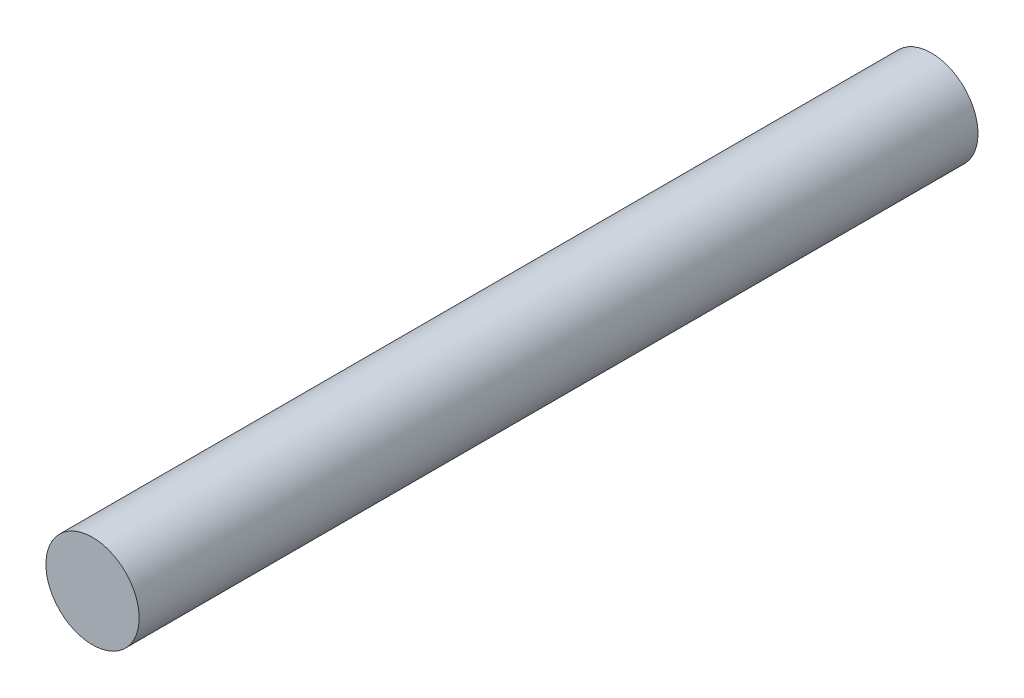
ISO-10303-21;
HEADER;
FILE_DESCRIPTION(('STEP AP214'),'2;1');
FILE_NAME('part.step','',(''),(''),'','','');
FILE_SCHEMA(('AUTOMOTIVE_DESIGN { 1 0 10303 214 1 1 1 1 }'));
ENDSEC;
DATA;
#1=APPLICATION_CONTEXT('core data for automotive mechanical design processes');
#2=APPLICATION_PROTOCOL_DEFINITION('international standard','automotive_design',2000,#1);
#3=PRODUCT_CONTEXT('',#1,'mechanical');
#4=PRODUCT('Part','Part','',(#3));
#5=PRODUCT_RELATED_PRODUCT_CATEGORY('part','',(#4));
#6=PRODUCT_DEFINITION_FORMATION('','',#4);
#7=PRODUCT_DEFINITION_CONTEXT('part definition',#1,'design');
#8=PRODUCT_DEFINITION('design','',#6,#7);
#9=PRODUCT_DEFINITION_SHAPE('','',#8);
#10=(LENGTH_UNIT() NAMED_UNIT(*) SI_UNIT(.MILLI.,.METRE.));
#11=(NAMED_UNIT(*) PLANE_ANGLE_UNIT() SI_UNIT($,.RADIAN.));
#12=(NAMED_UNIT(*) SI_UNIT($,.STERADIAN.) SOLID_ANGLE_UNIT());
#13=UNCERTAINTY_MEASURE_WITH_UNIT(LENGTH_MEASURE(1.E-05),#10,'distance_accuracy_value','');
#14=(GEOMETRIC_REPRESENTATION_CONTEXT(3) GLOBAL_UNCERTAINTY_ASSIGNED_CONTEXT((#13)) GLOBAL_UNIT_ASSIGNED_CONTEXT((#10,
#11,#12)) REPRESENTATION_CONTEXT('',''));
#15=CARTESIAN_POINT('',(0.,0.,0.));
#16=DIRECTION('',(0.,0.,1.));
#17=DIRECTION('',(1.,0.,0.));
#18=AXIS2_PLACEMENT_3D('',#15,#16,#17);
#19=CARTESIAN_POINT('',(-5.824,-4.501,-9.1));
#20=DIRECTION('',(0.,0.,-1.));
#21=DIRECTION('',(-1.,0.,0.));
#22=AXIS2_PLACEMENT_3D('',#19,#20,#21);
#23=PLANE('',#22);
#24=CARTESIAN_POINT('',(-6.125,-4.2,-9.1));
#25=DIRECTION('',(0.,0.,1.));
#26=DIRECTION('',(1.,0.,0.));
#27=AXIS2_PLACEMENT_3D('',#24,#25,#26);
#28=CIRCLE('',#27,0.300000000000001);
#29=CARTESIAN_POINT('',(-5.825,-4.2,-9.1));
#30=VERTEX_POINT('',#29);
#31=EDGE_CURVE('E19',#30,#30,#28,.T.);
#32=ORIENTED_EDGE('',*,*,#31,.F.);
#33=EDGE_LOOP('',(#32));
#34=FACE_BOUND('',#33,.T.);
#35=ADVANCED_FACE('F15',(#34),#23,.T.);
#36=CARTESIAN_POINT('',(-6.125,-4.2,-9.1));
#37=DIRECTION('',(0.,0.,1.));
#38=DIRECTION('',(1.,0.,0.));
#39=AXIS2_PLACEMENT_3D('',#36,#37,#38);
#40=CYLINDRICAL_SURFACE('',#39,0.300000000000001);
#41=CARTESIAN_POINT('',(-6.125,-4.2,-3.7));
#42=DIRECTION('',(0.,0.,1.));
#43=DIRECTION('',(1.,0.,0.));
#44=AXIS2_PLACEMENT_3D('',#41,#42,#43);
#45=CIRCLE('',#44,0.300000000000001);
#46=CARTESIAN_POINT('',(-5.825,-4.2,-3.7));
#47=VERTEX_POINT('',#46);
#48=EDGE_CURVE('E10',#47,#47,#45,.T.);
#49=ORIENTED_EDGE('',*,*,#48,.F.);
#50=EDGE_LOOP('',(#49));
#51=FACE_BOUND('',#50,.T.);
#52=ORIENTED_EDGE('',*,*,#31,.T.);
#53=EDGE_LOOP('',(#52));
#54=FACE_BOUND('',#53,.T.);
#55=ADVANCED_FACE('F28',(#51,#54),#40,.T.);
#56=CARTESIAN_POINT('',(-5.824,-3.899,-3.7));
#57=DIRECTION('',(0.,0.,1.));
#58=DIRECTION('',(-1.,0.,0.));
#59=AXIS2_PLACEMENT_3D('',#56,#57,#58);
#60=PLANE('',#59);
#61=ORIENTED_EDGE('',*,*,#48,.T.);
#62=EDGE_LOOP('',(#61));
#63=FACE_BOUND('',#62,.T.);
#64=ADVANCED_FACE('F17',(#63),#60,.T.);
#65=CLOSED_SHELL('',(#35,#55,#64));
#66=MANIFOLD_SOLID_BREP('B1',#65);
#67=ADVANCED_BREP_SHAPE_REPRESENTATION('',(#18,#66),#14);
#68=SHAPE_DEFINITION_REPRESENTATION(#9,#67);
ENDSEC;
END-ISO-10303-21;
